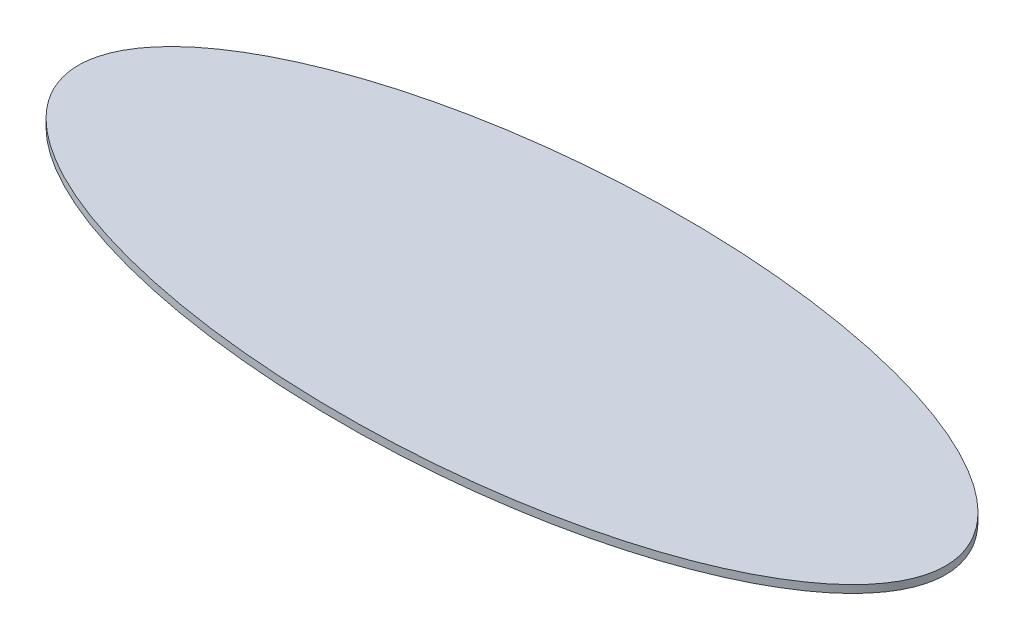
ISO-10303-21;
HEADER;
FILE_DESCRIPTION(('STEP AP214'),'2;1');
FILE_NAME('part.step','',(''),(''),'','','');
FILE_SCHEMA(('AUTOMOTIVE_DESIGN { 1 0 10303 214 1 1 1 1 }'));
ENDSEC;
DATA;
#1=APPLICATION_CONTEXT('core data for automotive mechanical design processes');
#2=APPLICATION_PROTOCOL_DEFINITION('international standard','automotive_design',2000,#1);
#3=PRODUCT_CONTEXT('',#1,'mechanical');
#4=PRODUCT('Part','Part','',(#3));
#5=PRODUCT_RELATED_PRODUCT_CATEGORY('part','',(#4));
#6=PRODUCT_DEFINITION_FORMATION('','',#4);
#7=PRODUCT_DEFINITION_CONTEXT('part definition',#1,'design');
#8=PRODUCT_DEFINITION('design','',#6,#7);
#9=PRODUCT_DEFINITION_SHAPE('','',#8);
#10=(LENGTH_UNIT() NAMED_UNIT(*) SI_UNIT(.MILLI.,.METRE.));
#11=(NAMED_UNIT(*) PLANE_ANGLE_UNIT() SI_UNIT($,.RADIAN.));
#12=(NAMED_UNIT(*) SI_UNIT($,.STERADIAN.) SOLID_ANGLE_UNIT());
#13=UNCERTAINTY_MEASURE_WITH_UNIT(LENGTH_MEASURE(1.E-05),#10,'distance_accuracy_value','');
#14=(GEOMETRIC_REPRESENTATION_CONTEXT(3) GLOBAL_UNCERTAINTY_ASSIGNED_CONTEXT((#13)) GLOBAL_UNIT_ASSIGNED_CONTEXT((#10,
#11,#12)) REPRESENTATION_CONTEXT('',''));
#15=CARTESIAN_POINT('',(0.,0.,0.));
#16=DIRECTION('',(0.,0.,1.));
#17=DIRECTION('',(1.,0.,0.));
#18=AXIS2_PLACEMENT_3D('',#15,#16,#17);
#19=CARTESIAN_POINT('',(0.,0.5,0.));
#20=DIRECTION('',(0.,1.,0.));
#21=DIRECTION('',(1.,0.,0.));
#22=AXIS2_PLACEMENT_3D('',#19,#20,#21);
#23=ELLIPSE('',#22,28.215,11.11);
#24=DIRECTION('',(0.,-1.,0.));
#25=VECTOR('',#24,1.);
#26=SURFACE_OF_LINEAR_EXTRUSION('',#23,#25);
#27=CARTESIAN_POINT('',(28.215,0.5,0.));
#28=VERTEX_POINT('',#27);
#29=EDGE_CURVE('E10',#28,#28,#23,.T.);
#30=ORIENTED_EDGE('',*,*,#29,.F.);
#31=EDGE_LOOP('',(#30));
#32=FACE_BOUND('',#31,.T.);
#33=CARTESIAN_POINT('',(0.,0.,0.));
#34=DIRECTION('',(0.,1.,0.));
#35=DIRECTION('',(1.,0.,0.));
#36=AXIS2_PLACEMENT_3D('',#33,#34,#35);
#37=ELLIPSE('',#36,28.215,11.11);
#38=CARTESIAN_POINT('',(28.215,0.,0.));
#39=VERTEX_POINT('',#38);
#40=EDGE_CURVE('E45',#39,#39,#37,.T.);
#41=ORIENTED_EDGE('',*,*,#40,.T.);
#42=EDGE_LOOP('',(#41));
#43=FACE_BOUND('',#42,.T.);
#44=ADVANCED_FACE('F41',(#32,#43),#26,.F.);
#45=CARTESIAN_POINT('',(0.,0.5,0.));
#46=DIRECTION('',(0.,1.,0.));
#47=DIRECTION('',(0.,0.,1.));
#48=AXIS2_PLACEMENT_3D('',#45,#46,#47);
#49=PLANE('',#48);
#50=ORIENTED_EDGE('',*,*,#29,.T.);
#51=EDGE_LOOP('',(#50));
#52=FACE_BOUND('',#51,.T.);
#53=ADVANCED_FACE('F57',(#52),#49,.T.);
#54=CARTESIAN_POINT('',(0.,0.,0.));
#55=DIRECTION('',(0.,1.,0.));
#56=DIRECTION('',(0.,0.,1.));
#57=AXIS2_PLACEMENT_3D('',#54,#55,#56);
#58=PLANE('',#57);
#59=ORIENTED_EDGE('',*,*,#40,.F.);
#60=EDGE_LOOP('',(#59));
#61=FACE_BOUND('',#60,.T.);
#62=ADVANCED_FACE('F55',(#61),#58,.F.);
#63=CLOSED_SHELL('',(#44,#53,#62));
#64=MANIFOLD_SOLID_BREP('B2',#63);
#65=ADVANCED_BREP_SHAPE_REPRESENTATION('',(#18,#64),#14);
#66=SHAPE_DEFINITION_REPRESENTATION(#9,#65);
ENDSEC;
END-ISO-10303-21;
